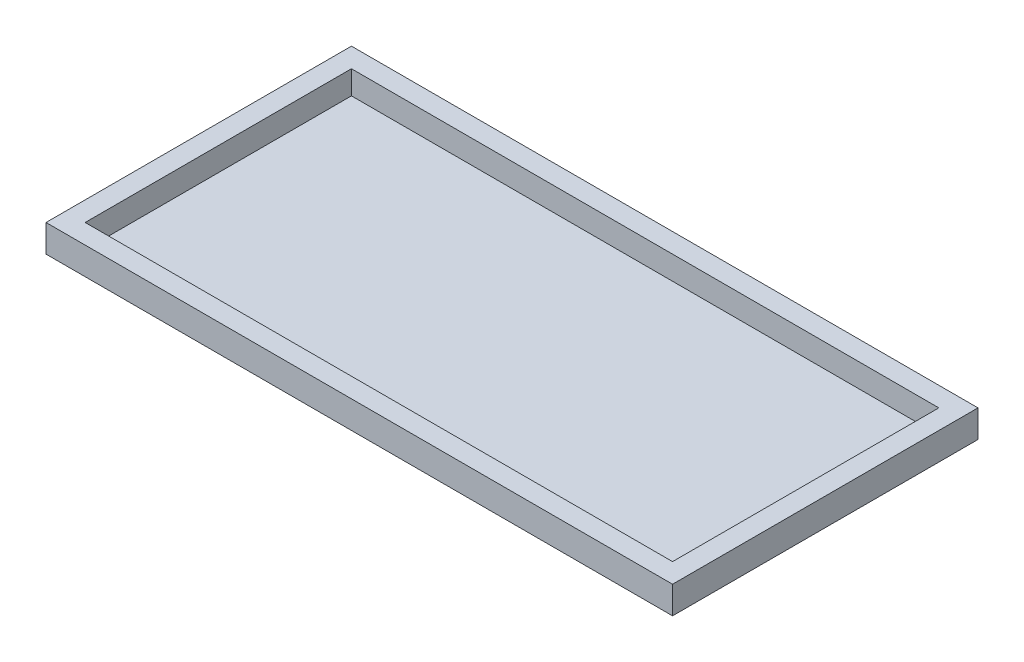
ISO-10303-21;
HEADER;
FILE_DESCRIPTION(('STEP AP214'),'2;1');
FILE_NAME('part.step','',(''),(''),'','','');
FILE_SCHEMA(('AUTOMOTIVE_DESIGN { 1 0 10303 214 1 1 1 1 }'));
ENDSEC;
DATA;
#1=APPLICATION_CONTEXT('core data for automotive mechanical design processes');
#2=APPLICATION_PROTOCOL_DEFINITION('international standard','automotive_design',2000,#1);
#3=PRODUCT_CONTEXT('',#1,'mechanical');
#4=PRODUCT('Part','Part','',(#3));
#5=PRODUCT_RELATED_PRODUCT_CATEGORY('part','',(#4));
#6=PRODUCT_DEFINITION_FORMATION('','',#4);
#7=PRODUCT_DEFINITION_CONTEXT('part definition',#1,'design');
#8=PRODUCT_DEFINITION('design','',#6,#7);
#9=PRODUCT_DEFINITION_SHAPE('','',#8);
#10=(LENGTH_UNIT() NAMED_UNIT(*) SI_UNIT(.MILLI.,.METRE.));
#11=(NAMED_UNIT(*) PLANE_ANGLE_UNIT() SI_UNIT($,.RADIAN.));
#12=(NAMED_UNIT(*) SI_UNIT($,.STERADIAN.) SOLID_ANGLE_UNIT());
#13=UNCERTAINTY_MEASURE_WITH_UNIT(LENGTH_MEASURE(1.E-05),#10,'distance_accuracy_value','');
#14=(GEOMETRIC_REPRESENTATION_CONTEXT(3) GLOBAL_UNCERTAINTY_ASSIGNED_CONTEXT((#13)) GLOBAL_UNIT_ASSIGNED_CONTEXT((#10,
#11,#12)) REPRESENTATION_CONTEXT('',''));
#15=CARTESIAN_POINT('',(0.,0.,0.));
#16=DIRECTION('',(0.,0.,1.));
#17=DIRECTION('',(1.,0.,0.));
#18=AXIS2_PLACEMENT_3D('',#15,#16,#17);
#19=CARTESIAN_POINT('',(0.,6.,0.));
#20=DIRECTION('',(0.,-1.,0.));
#21=DIRECTION('',(0.,0.,-1.));
#22=AXIS2_PLACEMENT_3D('',#19,#20,#21);
#23=PLANE('',#22);
#24=DIRECTION('',(0.,0.,-1.));
#25=VECTOR('',#24,1.);
#26=CARTESIAN_POINT('',(80.,6.,39.));
#27=LINE('',#26,#25);
#28=CARTESIAN_POINT('',(80.,6.,39.));
#29=VERTEX_POINT('',#28);
#30=CARTESIAN_POINT('',(80.,6.,-39.));
#31=VERTEX_POINT('',#30);
#32=EDGE_CURVE('E106',#29,#31,#27,.T.);
#33=ORIENTED_EDGE('',*,*,#32,.T.);
#34=DIRECTION('',(-1.,0.,0.));
#35=VECTOR('',#34,1.);
#36=CARTESIAN_POINT('',(-80.,6.,-39.));
#37=LINE('',#36,#35);
#38=CARTESIAN_POINT('',(-80.,6.,-39.));
#39=VERTEX_POINT('',#38);
#40=EDGE_CURVE('E155',#31,#39,#37,.T.);
#41=ORIENTED_EDGE('',*,*,#40,.T.);
#42=DIRECTION('',(0.,0.,1.));
#43=VECTOR('',#42,1.);
#44=CARTESIAN_POINT('',(-80.,6.,39.));
#45=LINE('',#44,#43);
#46=CARTESIAN_POINT('',(-80.,6.,39.));
#47=VERTEX_POINT('',#46);
#48=EDGE_CURVE('E157',#39,#47,#45,.T.);
#49=ORIENTED_EDGE('',*,*,#48,.T.);
#50=DIRECTION('',(1.,0.,0.));
#51=VECTOR('',#50,1.);
#52=CARTESIAN_POINT('',(-80.,6.,39.));
#53=LINE('',#52,#51);
#54=EDGE_CURVE('E110',#47,#29,#53,.T.);
#55=ORIENTED_EDGE('',*,*,#54,.T.);
#56=EDGE_LOOP('',(#33,#41,#49,#55));
#57=FACE_BOUND('',#56,.T.);
#58=DIRECTION('',(0.,0.,-1.));
#59=VECTOR('',#58,1.);
#60=CARTESIAN_POINT('',(75.,6.,34.));
#61=LINE('',#60,#59);
#62=CARTESIAN_POINT('',(75.,6.,34.));
#63=VERTEX_POINT('',#62);
#64=CARTESIAN_POINT('',(75.,6.,-34.));
#65=VERTEX_POINT('',#64);
#66=EDGE_CURVE('E129',#63,#65,#61,.T.);
#67=ORIENTED_EDGE('',*,*,#66,.F.);
#68=DIRECTION('',(1.,0.,0.));
#69=VECTOR('',#68,1.);
#70=CARTESIAN_POINT('',(-75.,6.,34.));
#71=LINE('',#70,#69);
#72=CARTESIAN_POINT('',(-75.,6.,34.));
#73=VERTEX_POINT('',#72);
#74=EDGE_CURVE('E136',#73,#63,#71,.T.);
#75=ORIENTED_EDGE('',*,*,#74,.F.);
#76=DIRECTION('',(0.,0.,1.));
#77=VECTOR('',#76,1.);
#78=CARTESIAN_POINT('',(-75.,6.,34.));
#79=LINE('',#78,#77);
#80=CARTESIAN_POINT('',(-75.,6.,-34.));
#81=VERTEX_POINT('',#80);
#82=EDGE_CURVE('E134',#81,#73,#79,.T.);
#83=ORIENTED_EDGE('',*,*,#82,.F.);
#84=DIRECTION('',(-1.,0.,0.));
#85=VECTOR('',#84,1.);
#86=CARTESIAN_POINT('',(-75.,6.,-34.));
#87=LINE('',#86,#85);
#88=EDGE_CURVE('E131',#65,#81,#87,.T.);
#89=ORIENTED_EDGE('',*,*,#88,.F.);
#90=EDGE_LOOP('',(#67,#75,#83,#89));
#91=FACE_BOUND('',#90,.T.);
#92=ADVANCED_FACE('F33',(#57,#91),#23,.F.);
#93=CARTESIAN_POINT('',(80.,6.,39.));
#94=DIRECTION('',(-1.,0.,0.));
#95=DIRECTION('',(0.,0.,1.));
#96=AXIS2_PLACEMENT_3D('',#93,#94,#95);
#97=PLANE('',#96);
#98=DIRECTION('',(0.,-1.,0.));
#99=VECTOR('',#98,1.);
#100=CARTESIAN_POINT('',(80.,6.,39.));
#101=LINE('',#100,#99);
#102=CARTESIAN_POINT('',(80.,-1.,39.));
#103=VERTEX_POINT('',#102);
#104=EDGE_CURVE('E100',#29,#103,#101,.T.);
#105=ORIENTED_EDGE('',*,*,#104,.T.);
#106=DIRECTION('',(0.,0.,1.));
#107=VECTOR('',#106,1.);
#108=CARTESIAN_POINT('',(80.,-1.,-39.));
#109=LINE('',#108,#107);
#110=CARTESIAN_POINT('',(80.,-1.,-39.));
#111=VERTEX_POINT('',#110);
#112=EDGE_CURVE('E104',#111,#103,#109,.T.);
#113=ORIENTED_EDGE('',*,*,#112,.F.);
#114=DIRECTION('',(0.,-1.,0.));
#115=VECTOR('',#114,1.);
#116=CARTESIAN_POINT('',(80.,6.,-39.));
#117=LINE('',#116,#115);
#118=EDGE_CURVE('E11',#31,#111,#117,.T.);
#119=ORIENTED_EDGE('',*,*,#118,.F.);
#120=ORIENTED_EDGE('',*,*,#32,.F.);
#121=EDGE_LOOP('',(#105,#113,#119,#120));
#122=FACE_BOUND('',#121,.T.);
#123=ADVANCED_FACE('F35',(#122),#97,.F.);
#124=CARTESIAN_POINT('',(-80.,6.,-39.));
#125=DIRECTION('',(0.,0.,1.));
#126=DIRECTION('',(1.,0.,0.));
#127=AXIS2_PLACEMENT_3D('',#124,#125,#126);
#128=PLANE('',#127);
#129=ORIENTED_EDGE('',*,*,#118,.T.);
#130=DIRECTION('',(1.,0.,0.));
#131=VECTOR('',#130,1.);
#132=CARTESIAN_POINT('',(-80.,-1.,-39.));
#133=LINE('',#132,#131);
#134=CARTESIAN_POINT('',(-80.,-1.,-39.));
#135=VERTEX_POINT('',#134);
#136=EDGE_CURVE('E124',#135,#111,#133,.T.);
#137=ORIENTED_EDGE('',*,*,#136,.F.);
#138=DIRECTION('',(0.,-1.,0.));
#139=VECTOR('',#138,1.);
#140=CARTESIAN_POINT('',(-80.,6.,-39.));
#141=LINE('',#140,#139);
#142=EDGE_CURVE('E41',#39,#135,#141,.T.);
#143=ORIENTED_EDGE('',*,*,#142,.F.);
#144=ORIENTED_EDGE('',*,*,#40,.F.);
#145=EDGE_LOOP('',(#129,#137,#143,#144));
#146=FACE_BOUND('',#145,.T.);
#147=ADVANCED_FACE('F165',(#146),#128,.F.);
#148=CARTESIAN_POINT('',(-80.,6.,39.));
#149=DIRECTION('',(1.,0.,0.));
#150=DIRECTION('',(0.,0.,-1.));
#151=AXIS2_PLACEMENT_3D('',#148,#149,#150);
#152=PLANE('',#151);
#153=ORIENTED_EDGE('',*,*,#142,.T.);
#154=DIRECTION('',(0.,0.,-1.));
#155=VECTOR('',#154,1.);
#156=CARTESIAN_POINT('',(-80.,-1.,-39.));
#157=LINE('',#156,#155);
#158=CARTESIAN_POINT('',(-80.,-1.,39.));
#159=VERTEX_POINT('',#158);
#160=EDGE_CURVE('E119',#159,#135,#157,.T.);
#161=ORIENTED_EDGE('',*,*,#160,.F.);
#162=DIRECTION('',(0.,-1.,0.));
#163=VECTOR('',#162,1.);
#164=CARTESIAN_POINT('',(-80.,6.,39.));
#165=LINE('',#164,#163);
#166=EDGE_CURVE('E109',#47,#159,#165,.T.);
#167=ORIENTED_EDGE('',*,*,#166,.F.);
#168=ORIENTED_EDGE('',*,*,#48,.F.);
#169=EDGE_LOOP('',(#153,#161,#167,#168));
#170=FACE_BOUND('',#169,.T.);
#171=ADVANCED_FACE('F163',(#170),#152,.F.);
#172=CARTESIAN_POINT('',(-80.,6.,39.));
#173=DIRECTION('',(0.,0.,-1.));
#174=DIRECTION('',(-1.,0.,0.));
#175=AXIS2_PLACEMENT_3D('',#172,#173,#174);
#176=PLANE('',#175);
#177=ORIENTED_EDGE('',*,*,#166,.T.);
#178=DIRECTION('',(-1.,0.,0.));
#179=VECTOR('',#178,1.);
#180=CARTESIAN_POINT('',(-80.,-1.,39.));
#181=LINE('',#180,#179);
#182=EDGE_CURVE('E113',#103,#159,#181,.T.);
#183=ORIENTED_EDGE('',*,*,#182,.F.);
#184=ORIENTED_EDGE('',*,*,#104,.F.);
#185=ORIENTED_EDGE('',*,*,#54,.F.);
#186=EDGE_LOOP('',(#177,#183,#184,#185));
#187=FACE_BOUND('',#186,.T.);
#188=ADVANCED_FACE('F114',(#187),#176,.F.);
#189=CARTESIAN_POINT('',(75.,6.,34.));
#190=DIRECTION('',(-1.,0.,0.));
#191=DIRECTION('',(0.,0.,1.));
#192=AXIS2_PLACEMENT_3D('',#189,#190,#191);
#193=PLANE('',#192);
#194=DIRECTION('',(0.,0.,-1.));
#195=VECTOR('',#194,1.);
#196=CARTESIAN_POINT('',(75.,0.,34.));
#197=LINE('',#196,#195);
#198=CARTESIAN_POINT('',(75.,0.,34.));
#199=VERTEX_POINT('',#198);
#200=CARTESIAN_POINT('',(75.,0.,-34.));
#201=VERTEX_POINT('',#200);
#202=EDGE_CURVE('E56',#199,#201,#197,.T.);
#203=ORIENTED_EDGE('',*,*,#202,.F.);
#204=DIRECTION('',(0.,-1.,0.));
#205=VECTOR('',#204,1.);
#206=CARTESIAN_POINT('',(75.,6.,34.));
#207=LINE('',#206,#205);
#208=EDGE_CURVE('E138',#63,#199,#207,.T.);
#209=ORIENTED_EDGE('',*,*,#208,.F.);
#210=ORIENTED_EDGE('',*,*,#66,.T.);
#211=DIRECTION('',(0.,-1.,0.));
#212=VECTOR('',#211,1.);
#213=CARTESIAN_POINT('',(75.,6.,-34.));
#214=LINE('',#213,#212);
#215=EDGE_CURVE('E152',#65,#201,#214,.T.);
#216=ORIENTED_EDGE('',*,*,#215,.T.);
#217=EDGE_LOOP('',(#203,#209,#210,#216));
#218=FACE_BOUND('',#217,.T.);
#219=ADVANCED_FACE('F175',(#218),#193,.T.);
#220=CARTESIAN_POINT('',(-75.,6.,-34.));
#221=DIRECTION('',(0.,0.,1.));
#222=DIRECTION('',(1.,0.,0.));
#223=AXIS2_PLACEMENT_3D('',#220,#221,#222);
#224=PLANE('',#223);
#225=DIRECTION('',(-1.,0.,0.));
#226=VECTOR('',#225,1.);
#227=CARTESIAN_POINT('',(-75.,0.,-34.));
#228=LINE('',#227,#226);
#229=CARTESIAN_POINT('',(-75.,0.,-34.));
#230=VERTEX_POINT('',#229);
#231=EDGE_CURVE('E140',#201,#230,#228,.T.);
#232=ORIENTED_EDGE('',*,*,#231,.F.);
#233=ORIENTED_EDGE('',*,*,#215,.F.);
#234=ORIENTED_EDGE('',*,*,#88,.T.);
#235=DIRECTION('',(0.,-1.,0.));
#236=VECTOR('',#235,1.);
#237=CARTESIAN_POINT('',(-75.,6.,-34.));
#238=LINE('',#237,#236);
#239=EDGE_CURVE('E150',#81,#230,#238,.T.);
#240=ORIENTED_EDGE('',*,*,#239,.T.);
#241=EDGE_LOOP('',(#232,#233,#234,#240));
#242=FACE_BOUND('',#241,.T.);
#243=ADVANCED_FACE('F177',(#242),#224,.T.);
#244=CARTESIAN_POINT('',(-75.,6.,34.));
#245=DIRECTION('',(1.,0.,0.));
#246=DIRECTION('',(0.,0.,-1.));
#247=AXIS2_PLACEMENT_3D('',#244,#245,#246);
#248=PLANE('',#247);
#249=DIRECTION('',(0.,0.,1.));
#250=VECTOR('',#249,1.);
#251=CARTESIAN_POINT('',(-75.,0.,34.));
#252=LINE('',#251,#250);
#253=CARTESIAN_POINT('',(-75.,0.,34.));
#254=VERTEX_POINT('',#253);
#255=EDGE_CURVE('E143',#230,#254,#252,.T.);
#256=ORIENTED_EDGE('',*,*,#255,.F.);
#257=ORIENTED_EDGE('',*,*,#239,.F.);
#258=ORIENTED_EDGE('',*,*,#82,.T.);
#259=DIRECTION('',(0.,-1.,0.));
#260=VECTOR('',#259,1.);
#261=CARTESIAN_POINT('',(-75.,6.,34.));
#262=LINE('',#261,#260);
#263=EDGE_CURVE('E48',#73,#254,#262,.T.);
#264=ORIENTED_EDGE('',*,*,#263,.T.);
#265=EDGE_LOOP('',(#256,#257,#258,#264));
#266=FACE_BOUND('',#265,.T.);
#267=ADVANCED_FACE('F184',(#266),#248,.T.);
#268=CARTESIAN_POINT('',(-75.,6.,34.));
#269=DIRECTION('',(0.,0.,-1.));
#270=DIRECTION('',(-1.,0.,0.));
#271=AXIS2_PLACEMENT_3D('',#268,#269,#270);
#272=PLANE('',#271);
#273=DIRECTION('',(1.,0.,0.));
#274=VECTOR('',#273,1.);
#275=CARTESIAN_POINT('',(-75.,0.,34.));
#276=LINE('',#275,#274);
#277=EDGE_CURVE('E132',#254,#199,#276,.T.);
#278=ORIENTED_EDGE('',*,*,#277,.F.);
#279=ORIENTED_EDGE('',*,*,#263,.F.);
#280=ORIENTED_EDGE('',*,*,#74,.T.);
#281=ORIENTED_EDGE('',*,*,#208,.T.);
#282=EDGE_LOOP('',(#278,#279,#280,#281));
#283=FACE_BOUND('',#282,.T.);
#284=ADVANCED_FACE('F182',(#283),#272,.T.);
#285=CARTESIAN_POINT('',(0.,0.,0.));
#286=DIRECTION('',(0.,1.,0.));
#287=DIRECTION('',(0.,0.,1.));
#288=AXIS2_PLACEMENT_3D('',#285,#286,#287);
#289=PLANE('',#288);
#290=ORIENTED_EDGE('',*,*,#255,.T.);
#291=ORIENTED_EDGE('',*,*,#277,.T.);
#292=ORIENTED_EDGE('',*,*,#202,.T.);
#293=ORIENTED_EDGE('',*,*,#231,.T.);
#294=EDGE_LOOP('',(#290,#291,#292,#293));
#295=FACE_BOUND('',#294,.T.);
#296=ADVANCED_FACE('F181',(#295),#289,.T.);
#297=CARTESIAN_POINT('',(0.,-1.,0.));
#298=DIRECTION('',(0.,1.,0.));
#299=DIRECTION('',(0.,0.,1.));
#300=AXIS2_PLACEMENT_3D('',#297,#298,#299);
#301=PLANE('',#300);
#302=ORIENTED_EDGE('',*,*,#112,.T.);
#303=ORIENTED_EDGE('',*,*,#182,.T.);
#304=ORIENTED_EDGE('',*,*,#160,.T.);
#305=ORIENTED_EDGE('',*,*,#136,.T.);
#306=EDGE_LOOP('',(#302,#303,#304,#305));
#307=FACE_BOUND('',#306,.T.);
#308=ADVANCED_FACE('F122',(#307),#301,.F.);
#309=CLOSED_SHELL('',(#92,#123,#147,#171,#188,#219,#243,#267,#284,#296,#308));
#310=MANIFOLD_SOLID_BREP('B2',#309);
#311=ADVANCED_BREP_SHAPE_REPRESENTATION('',(#18,#310),#14);
#312=SHAPE_DEFINITION_REPRESENTATION(#9,#311);
ENDSEC;
END-ISO-10303-21;
